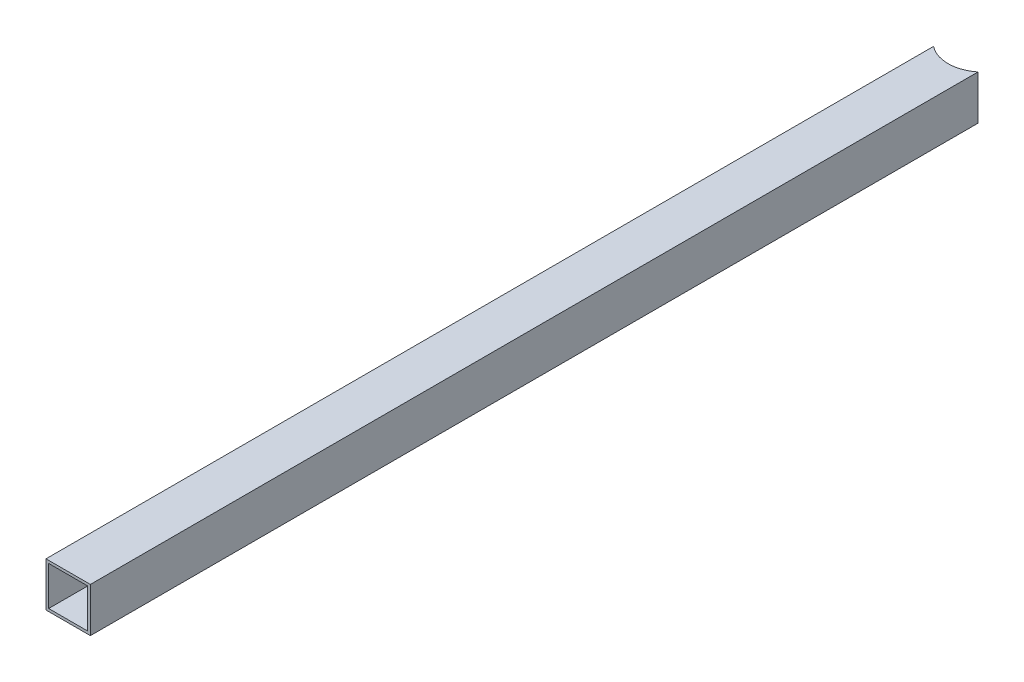
ISO-10303-21;
HEADER;
FILE_DESCRIPTION(('STEP AP214'),'2;1');
FILE_NAME('part.step','',(''),(''),'','','');
FILE_SCHEMA(('AUTOMOTIVE_DESIGN { 1 0 10303 214 1 1 1 1 }'));
ENDSEC;
DATA;
#1=APPLICATION_CONTEXT('core data for automotive mechanical design processes');
#2=APPLICATION_PROTOCOL_DEFINITION('international standard','automotive_design',2000,#1);
#3=PRODUCT_CONTEXT('',#1,'mechanical');
#4=PRODUCT('Part','Part','',(#3));
#5=PRODUCT_RELATED_PRODUCT_CATEGORY('part','',(#4));
#6=PRODUCT_DEFINITION_FORMATION('','',#4);
#7=PRODUCT_DEFINITION_CONTEXT('part definition',#1,'design');
#8=PRODUCT_DEFINITION('design','',#6,#7);
#9=PRODUCT_DEFINITION_SHAPE('','',#8);
#10=(LENGTH_UNIT() NAMED_UNIT(*) SI_UNIT(.MILLI.,.METRE.));
#11=(NAMED_UNIT(*) PLANE_ANGLE_UNIT() SI_UNIT($,.RADIAN.));
#12=(NAMED_UNIT(*) SI_UNIT($,.STERADIAN.) SOLID_ANGLE_UNIT());
#13=UNCERTAINTY_MEASURE_WITH_UNIT(LENGTH_MEASURE(1.E-05),#10,'distance_accuracy_value','');
#14=(GEOMETRIC_REPRESENTATION_CONTEXT(3) GLOBAL_UNCERTAINTY_ASSIGNED_CONTEXT((#13)) GLOBAL_UNIT_ASSIGNED_CONTEXT((#10,
#11,#12)) REPRESENTATION_CONTEXT('',''));
#15=CARTESIAN_POINT('',(0.,0.,0.));
#16=DIRECTION('',(0.,0.,1.));
#17=DIRECTION('',(1.,0.,0.));
#18=AXIS2_PLACEMENT_3D('',#15,#16,#17);
#19=CARTESIAN_POINT('',(25.,25.,1000.));
#20=DIRECTION('',(0.,-1.,0.));
#21=DIRECTION('',(0.,0.,-1.));
#22=AXIS2_PLACEMENT_3D('',#19,#20,#21);
#23=PLANE('',#22);
#24=DIRECTION('',(0.,0.,-1.));
#25=VECTOR('',#24,1.);
#26=CARTESIAN_POINT('',(25.,25.,1000.));
#27=LINE('',#26,#25);
#28=CARTESIAN_POINT('',(25.,25.,1000.));
#29=VERTEX_POINT('',#28);
#30=CARTESIAN_POINT('',(25.,25.,0.));
#31=VERTEX_POINT('',#30);
#32=EDGE_CURVE('E108',#29,#31,#27,.T.);
#33=ORIENTED_EDGE('',*,*,#32,.T.);
#34=CARTESIAN_POINT('',(0.,25.,-31.2249899919919));
#35=DIRECTION('',(0.,-1.,0.));
#36=DIRECTION('',(0.,0.,-1.));
#37=AXIS2_PLACEMENT_3D('',#34,#35,#36);
#38=CIRCLE('',#37,40.);
#39=CARTESIAN_POINT('',(-25.,25.,0.));
#40=VERTEX_POINT('',#39);
#41=EDGE_CURVE('E140',#31,#40,#38,.T.);
#42=ORIENTED_EDGE('',*,*,#41,.T.);
#43=DIRECTION('',(0.,0.,-1.));
#44=VECTOR('',#43,1.);
#45=CARTESIAN_POINT('',(-25.,25.,1000.));
#46=LINE('',#45,#44);
#47=CARTESIAN_POINT('',(-25.,25.,1000.));
#48=VERTEX_POINT('',#47);
#49=EDGE_CURVE('E24',#48,#40,#46,.T.);
#50=ORIENTED_EDGE('',*,*,#49,.F.);
#51=DIRECTION('',(-1.,0.,0.));
#52=VECTOR('',#51,1.);
#53=CARTESIAN_POINT('',(25.,25.,1000.));
#54=LINE('',#53,#52);
#55=EDGE_CURVE('E115',#29,#48,#54,.T.);
#56=ORIENTED_EDGE('',*,*,#55,.F.);
#57=EDGE_LOOP('',(#33,#42,#50,#56));
#58=FACE_BOUND('',#57,.T.);
#59=ADVANCED_FACE('F17',(#58),#23,.F.);
#60=CARTESIAN_POINT('',(-25.,25.,1000.));
#61=DIRECTION('',(1.,0.,0.));
#62=DIRECTION('',(0.,0.,-1.));
#63=AXIS2_PLACEMENT_3D('',#60,#61,#62);
#64=PLANE('',#63);
#65=DIRECTION('',(0.,-1.,0.));
#66=VECTOR('',#65,1.);
#67=CARTESIAN_POINT('',(-25.,25.,0.));
#68=LINE('',#67,#66);
#69=CARTESIAN_POINT('',(-25.,-25.,0.));
#70=VERTEX_POINT('',#69);
#71=EDGE_CURVE('E83',#40,#70,#68,.T.);
#72=ORIENTED_EDGE('',*,*,#71,.T.);
#73=DIRECTION('',(0.,0.,-1.));
#74=VECTOR('',#73,1.);
#75=CARTESIAN_POINT('',(-25.,-25.,1000.));
#76=LINE('',#75,#74);
#77=CARTESIAN_POINT('',(-25.,-25.,1000.));
#78=VERTEX_POINT('',#77);
#79=EDGE_CURVE('E98',#78,#70,#76,.T.);
#80=ORIENTED_EDGE('',*,*,#79,.F.);
#81=DIRECTION('',(0.,-1.,0.));
#82=VECTOR('',#81,1.);
#83=CARTESIAN_POINT('',(-25.,25.,1000.));
#84=LINE('',#83,#82);
#85=EDGE_CURVE('E119',#48,#78,#84,.T.);
#86=ORIENTED_EDGE('',*,*,#85,.F.);
#87=ORIENTED_EDGE('',*,*,#49,.T.);
#88=EDGE_LOOP('',(#72,#80,#86,#87));
#89=FACE_BOUND('',#88,.T.);
#90=ADVANCED_FACE('F97',(#89),#64,.F.);
#91=CARTESIAN_POINT('',(-25.,-25.,1000.));
#92=DIRECTION('',(0.,1.,0.));
#93=DIRECTION('',(0.,0.,1.));
#94=AXIS2_PLACEMENT_3D('',#91,#92,#93);
#95=PLANE('',#94);
#96=ORIENTED_EDGE('',*,*,#79,.T.);
#97=CARTESIAN_POINT('',(0.,-25.,-31.2249899919919));
#98=DIRECTION('',(0.,-1.,0.));
#99=DIRECTION('',(0.,0.,1.));
#100=AXIS2_PLACEMENT_3D('',#97,#98,#99);
#101=CIRCLE('',#100,40.);
#102=CARTESIAN_POINT('',(25.,-25.,0.));
#103=VERTEX_POINT('',#102);
#104=EDGE_CURVE('E80',#103,#70,#101,.T.);
#105=ORIENTED_EDGE('',*,*,#104,.F.);
#106=DIRECTION('',(0.,0.,-1.));
#107=VECTOR('',#106,1.);
#108=CARTESIAN_POINT('',(25.,-25.,1000.));
#109=LINE('',#108,#107);
#110=CARTESIAN_POINT('',(25.,-25.,1000.));
#111=VERTEX_POINT('',#110);
#112=EDGE_CURVE('E106',#111,#103,#109,.T.);
#113=ORIENTED_EDGE('',*,*,#112,.F.);
#114=DIRECTION('',(1.,0.,0.));
#115=VECTOR('',#114,1.);
#116=CARTESIAN_POINT('',(-25.,-25.,1000.));
#117=LINE('',#116,#115);
#118=EDGE_CURVE('E105',#78,#111,#117,.T.);
#119=ORIENTED_EDGE('',*,*,#118,.F.);
#120=EDGE_LOOP('',(#96,#105,#113,#119));
#121=FACE_BOUND('',#120,.T.);
#122=ADVANCED_FACE('F104',(#121),#95,.F.);
#123=CARTESIAN_POINT('',(25.,-25.,1000.));
#124=DIRECTION('',(-1.,0.,0.));
#125=DIRECTION('',(0.,0.,1.));
#126=AXIS2_PLACEMENT_3D('',#123,#124,#125);
#127=PLANE('',#126);
#128=DIRECTION('',(0.,1.,0.));
#129=VECTOR('',#128,1.);
#130=CARTESIAN_POINT('',(25.,-25.,0.));
#131=LINE('',#130,#129);
#132=EDGE_CURVE('E86',#103,#31,#131,.T.);
#133=ORIENTED_EDGE('',*,*,#132,.T.);
#134=ORIENTED_EDGE('',*,*,#32,.F.);
#135=DIRECTION('',(0.,1.,0.));
#136=VECTOR('',#135,1.);
#137=CARTESIAN_POINT('',(25.,-25.,1000.));
#138=LINE('',#137,#136);
#139=EDGE_CURVE('E113',#111,#29,#138,.T.);
#140=ORIENTED_EDGE('',*,*,#139,.F.);
#141=ORIENTED_EDGE('',*,*,#112,.T.);
#142=EDGE_LOOP('',(#133,#134,#140,#141));
#143=FACE_BOUND('',#142,.T.);
#144=ADVANCED_FACE('F181',(#143),#127,.F.);
#145=CARTESIAN_POINT('',(0.,0.,1000.));
#146=DIRECTION('',(0.,0.,1.));
#147=DIRECTION('',(1.,0.,0.));
#148=AXIS2_PLACEMENT_3D('',#145,#146,#147);
#149=PLANE('',#148);
#150=DIRECTION('',(1.,0.,0.));
#151=VECTOR('',#150,1.);
#152=CARTESIAN_POINT('',(0.,-22.,1000.));
#153=LINE('',#152,#151);
#154=CARTESIAN_POINT('',(-22.,-22.,1000.));
#155=VERTEX_POINT('',#154);
#156=CARTESIAN_POINT('',(22.,-22.,1000.));
#157=VERTEX_POINT('',#156);
#158=EDGE_CURVE('E102',#155,#157,#153,.T.);
#159=ORIENTED_EDGE('',*,*,#158,.F.);
#160=DIRECTION('',(0.,-1.,0.));
#161=VECTOR('',#160,1.);
#162=CARTESIAN_POINT('',(-22.,0.,1000.));
#163=LINE('',#162,#161);
#164=CARTESIAN_POINT('',(-22.,22.,1000.));
#165=VERTEX_POINT('',#164);
#166=EDGE_CURVE('E127',#165,#155,#163,.T.);
#167=ORIENTED_EDGE('',*,*,#166,.F.);
#168=DIRECTION('',(-1.,0.,0.));
#169=VECTOR('',#168,1.);
#170=CARTESIAN_POINT('',(0.,22.,1000.));
#171=LINE('',#170,#169);
#172=CARTESIAN_POINT('',(22.,22.,1000.));
#173=VERTEX_POINT('',#172);
#174=EDGE_CURVE('E125',#173,#165,#171,.T.);
#175=ORIENTED_EDGE('',*,*,#174,.F.);
#176=DIRECTION('',(0.,1.,0.));
#177=VECTOR('',#176,1.);
#178=CARTESIAN_POINT('',(22.,0.,1000.));
#179=LINE('',#178,#177);
#180=EDGE_CURVE('E123',#157,#173,#179,.T.);
#181=ORIENTED_EDGE('',*,*,#180,.F.);
#182=EDGE_LOOP('',(#159,#167,#175,#181));
#183=FACE_BOUND('',#182,.T.);
#184=ORIENTED_EDGE('',*,*,#55,.T.);
#185=ORIENTED_EDGE('',*,*,#85,.T.);
#186=ORIENTED_EDGE('',*,*,#118,.T.);
#187=ORIENTED_EDGE('',*,*,#139,.T.);
#188=EDGE_LOOP('',(#184,#185,#186,#187));
#189=FACE_BOUND('',#188,.T.);
#190=ADVANCED_FACE('F157',(#183,#189),#149,.T.);
#191=CARTESIAN_POINT('',(22.,-22.,1002.49688278817));
#192=DIRECTION('',(0.,-1.,0.));
#193=DIRECTION('',(0.,0.,-1.));
#194=AXIS2_PLACEMENT_3D('',#191,#192,#193);
#195=PLANE('',#194);
#196=DIRECTION('',(0.,0.,-1.));
#197=VECTOR('',#196,1.);
#198=CARTESIAN_POINT('',(22.,-22.,1002.49688278817));
#199=LINE('',#198,#197);
#200=CARTESIAN_POINT('',(22.,-22.,2.18159618498817));
#201=VERTEX_POINT('',#200);
#202=EDGE_CURVE('E137',#157,#201,#199,.T.);
#203=ORIENTED_EDGE('',*,*,#202,.T.);
#204=CARTESIAN_POINT('',(0.,-22.,-31.2249899919919));
#205=DIRECTION('',(0.,-1.,0.));
#206=DIRECTION('',(0.,0.,-1.));
#207=AXIS2_PLACEMENT_3D('',#204,#205,#206);
#208=CIRCLE('',#207,40.);
#209=CARTESIAN_POINT('',(-22.,-22.,2.18159618498826));
#210=VERTEX_POINT('',#209);
#211=EDGE_CURVE('E142',#201,#210,#208,.T.);
#212=ORIENTED_EDGE('',*,*,#211,.T.);
#213=DIRECTION('',(0.,0.,-1.));
#214=VECTOR('',#213,1.);
#215=CARTESIAN_POINT('',(-22.,-22.,1002.49688278817));
#216=LINE('',#215,#214);
#217=EDGE_CURVE('E38',#155,#210,#216,.T.);
#218=ORIENTED_EDGE('',*,*,#217,.F.);
#219=ORIENTED_EDGE('',*,*,#158,.T.);
#220=EDGE_LOOP('',(#203,#212,#218,#219));
#221=FACE_BOUND('',#220,.T.);
#222=ADVANCED_FACE('F163',(#221),#195,.F.);
#223=CARTESIAN_POINT('',(-22.,-22.,1002.49688278817));
#224=DIRECTION('',(-1.,0.,0.));
#225=DIRECTION('',(0.,0.,1.));
#226=AXIS2_PLACEMENT_3D('',#223,#224,#225);
#227=PLANE('',#226);
#228=ORIENTED_EDGE('',*,*,#217,.T.);
#229=DIRECTION('',(0.,-1.,0.));
#230=VECTOR('',#229,1.);
#231=CARTESIAN_POINT('',(-22.,1050.37108905872,2.18159618498817));
#232=LINE('',#231,#230);
#233=CARTESIAN_POINT('',(-22.,22.,2.18159618498817));
#234=VERTEX_POINT('',#233);
#235=EDGE_CURVE('E31',#210,#234,#232,.F.);
#236=ORIENTED_EDGE('',*,*,#235,.T.);
#237=DIRECTION('',(0.,0.,-1.));
#238=VECTOR('',#237,1.);
#239=CARTESIAN_POINT('',(-22.,22.,1002.49688278817));
#240=LINE('',#239,#238);
#241=EDGE_CURVE('E131',#165,#234,#240,.T.);
#242=ORIENTED_EDGE('',*,*,#241,.F.);
#243=ORIENTED_EDGE('',*,*,#166,.T.);
#244=EDGE_LOOP('',(#228,#236,#242,#243));
#245=FACE_BOUND('',#244,.T.);
#246=ADVANCED_FACE('F161',(#245),#227,.F.);
#247=CARTESIAN_POINT('',(-22.,22.,1002.49688278817));
#248=DIRECTION('',(0.,1.,0.));
#249=DIRECTION('',(0.,0.,1.));
#250=AXIS2_PLACEMENT_3D('',#247,#248,#249);
#251=PLANE('',#250);
#252=ORIENTED_EDGE('',*,*,#241,.T.);
#253=CARTESIAN_POINT('',(0.,22.,-31.2249899919919));
#254=DIRECTION('',(0.,1.,0.));
#255=DIRECTION('',(0.,0.,1.));
#256=AXIS2_PLACEMENT_3D('',#253,#254,#255);
#257=CIRCLE('',#256,40.);
#258=CARTESIAN_POINT('',(22.,22.,2.18159618498817));
#259=VERTEX_POINT('',#258);
#260=EDGE_CURVE('E92',#234,#259,#257,.T.);
#261=ORIENTED_EDGE('',*,*,#260,.T.);
#262=DIRECTION('',(0.,0.,-1.));
#263=VECTOR('',#262,1.);
#264=CARTESIAN_POINT('',(22.,22.,1002.49688278817));
#265=LINE('',#264,#263);
#266=EDGE_CURVE('E134',#173,#259,#265,.T.);
#267=ORIENTED_EDGE('',*,*,#266,.F.);
#268=ORIENTED_EDGE('',*,*,#174,.T.);
#269=EDGE_LOOP('',(#252,#261,#267,#268));
#270=FACE_BOUND('',#269,.T.);
#271=ADVANCED_FACE('F148',(#270),#251,.F.);
#272=CARTESIAN_POINT('',(22.,22.,1002.49688278817));
#273=DIRECTION('',(1.,0.,0.));
#274=DIRECTION('',(0.,0.,-1.));
#275=AXIS2_PLACEMENT_3D('',#272,#273,#274);
#276=PLANE('',#275);
#277=ORIENTED_EDGE('',*,*,#266,.T.);
#278=DIRECTION('',(0.,-1.,0.));
#279=VECTOR('',#278,1.);
#280=CARTESIAN_POINT('',(22.,1050.37108905872,2.18159618498817));
#281=LINE('',#280,#279);
#282=EDGE_CURVE('E10',#259,#201,#281,.T.);
#283=ORIENTED_EDGE('',*,*,#282,.T.);
#284=ORIENTED_EDGE('',*,*,#202,.F.);
#285=ORIENTED_EDGE('',*,*,#180,.T.);
#286=EDGE_LOOP('',(#277,#283,#284,#285));
#287=FACE_BOUND('',#286,.T.);
#288=ADVANCED_FACE('F152',(#287),#276,.F.);
#289=CARTESIAN_POINT('',(0.,1050.37108905872,-31.2249899919919));
#290=DIRECTION('',(0.,-1.,0.));
#291=DIRECTION('',(0.,0.,-1.));
#292=AXIS2_PLACEMENT_3D('',#289,#290,#291);
#293=CYLINDRICAL_SURFACE('',#292,40.);
#294=ORIENTED_EDGE('',*,*,#282,.F.);
#295=ORIENTED_EDGE('',*,*,#260,.F.);
#296=ORIENTED_EDGE('',*,*,#235,.F.);
#297=ORIENTED_EDGE('',*,*,#211,.F.);
#298=EDGE_LOOP('',(#294,#295,#296,#297));
#299=FACE_BOUND('',#298,.T.);
#300=ORIENTED_EDGE('',*,*,#41,.F.);
#301=ORIENTED_EDGE('',*,*,#132,.F.);
#302=ORIENTED_EDGE('',*,*,#104,.T.);
#303=ORIENTED_EDGE('',*,*,#71,.F.);
#304=EDGE_LOOP('',(#300,#301,#302,#303));
#305=FACE_BOUND('',#304,.T.);
#306=ADVANCED_FACE('F82',(#299,#305),#293,.F.);
#307=CLOSED_SHELL('',(#59,#90,#122,#144,#190,#222,#246,#271,#288,#306));
#308=MANIFOLD_SOLID_BREP('B1',#307);
#309=ADVANCED_BREP_SHAPE_REPRESENTATION('',(#18,#308),#14);
#310=SHAPE_DEFINITION_REPRESENTATION(#9,#309);
ENDSEC;
END-ISO-10303-21;
